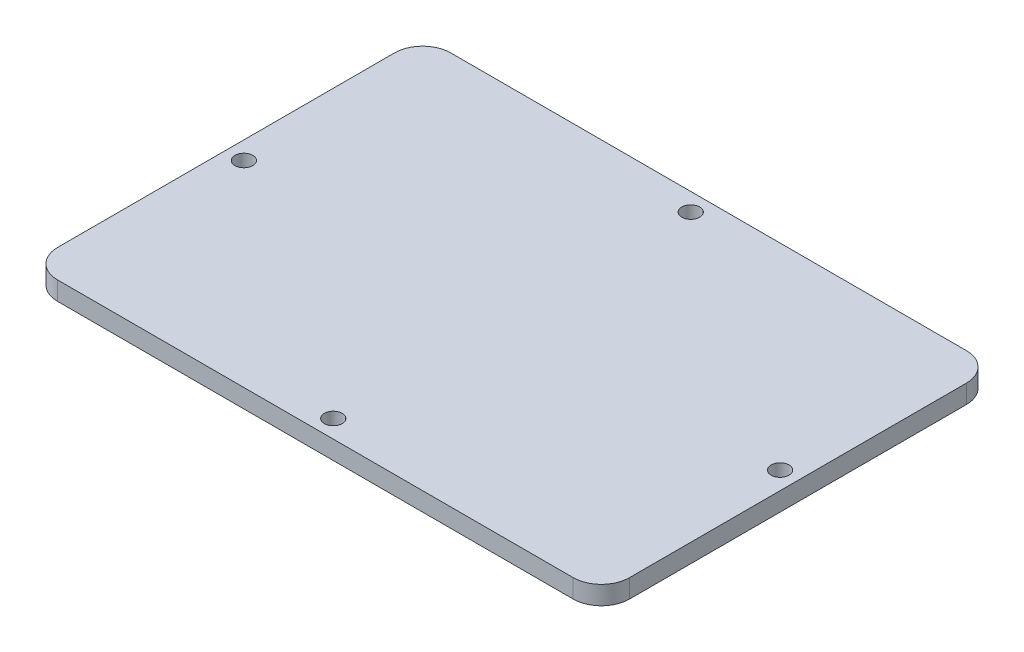
ISO-10303-21;
HEADER;
FILE_DESCRIPTION(('STEP AP214'),'2;1');
FILE_NAME('part.step','',(''),(''),'','','');
FILE_SCHEMA(('AUTOMOTIVE_DESIGN { 1 0 10303 214 1 1 1 1 }'));
ENDSEC;
DATA;
#1=APPLICATION_CONTEXT('core data for automotive mechanical design processes');
#2=APPLICATION_PROTOCOL_DEFINITION('international standard','automotive_design',2000,#1);
#3=PRODUCT_CONTEXT('',#1,'mechanical');
#4=PRODUCT('Part','Part','',(#3));
#5=PRODUCT_RELATED_PRODUCT_CATEGORY('part','',(#4));
#6=PRODUCT_DEFINITION_FORMATION('','',#4);
#7=PRODUCT_DEFINITION_CONTEXT('part definition',#1,'design');
#8=PRODUCT_DEFINITION('design','',#6,#7);
#9=PRODUCT_DEFINITION_SHAPE('','',#8);
#10=(LENGTH_UNIT() NAMED_UNIT(*) SI_UNIT(.MILLI.,.METRE.));
#11=(NAMED_UNIT(*) PLANE_ANGLE_UNIT() SI_UNIT($,.RADIAN.));
#12=(NAMED_UNIT(*) SI_UNIT($,.STERADIAN.) SOLID_ANGLE_UNIT());
#13=UNCERTAINTY_MEASURE_WITH_UNIT(LENGTH_MEASURE(1.E-05),#10,'distance_accuracy_value','');
#14=(GEOMETRIC_REPRESENTATION_CONTEXT(3) GLOBAL_UNCERTAINTY_ASSIGNED_CONTEXT((#13)) GLOBAL_UNIT_ASSIGNED_CONTEXT((#10,
#11,#12)) REPRESENTATION_CONTEXT('',''));
#15=CARTESIAN_POINT('',(0.,0.,0.));
#16=DIRECTION('',(0.,0.,1.));
#17=DIRECTION('',(1.,0.,0.));
#18=AXIS2_PLACEMENT_3D('',#15,#16,#17);
#19=CARTESIAN_POINT('',(50.8,3.302,34.925));
#20=DIRECTION('',(-1.,0.,0.));
#21=DIRECTION('',(0.,0.,1.));
#22=AXIS2_PLACEMENT_3D('',#19,#20,#21);
#23=PLANE('',#22);
#24=DIRECTION('',(0.,0.,-1.));
#25=VECTOR('',#24,1.);
#26=CARTESIAN_POINT('',(50.8,0.,34.925));
#27=LINE('',#26,#25);
#28=CARTESIAN_POINT('',(50.8,0.,29.925));
#29=VERTEX_POINT('',#28);
#30=CARTESIAN_POINT('',(50.8,0.,-29.925));
#31=VERTEX_POINT('',#30);
#32=EDGE_CURVE('E128',#29,#31,#27,.T.);
#33=ORIENTED_EDGE('',*,*,#32,.T.);
#34=DIRECTION('',(0.,-1.,0.));
#35=VECTOR('',#34,1.);
#36=CARTESIAN_POINT('',(50.8,3.302,-29.925));
#37=LINE('',#36,#35);
#38=CARTESIAN_POINT('',(50.8,3.302,-29.925));
#39=VERTEX_POINT('',#38);
#40=EDGE_CURVE('E106',#31,#39,#37,.F.);
#41=ORIENTED_EDGE('',*,*,#40,.T.);
#42=DIRECTION('',(0.,0.,-1.));
#43=VECTOR('',#42,1.);
#44=CARTESIAN_POINT('',(50.8,3.302,34.925));
#45=LINE('',#44,#43);
#46=CARTESIAN_POINT('',(50.8,3.302,29.925));
#47=VERTEX_POINT('',#46);
#48=EDGE_CURVE('E138',#47,#39,#45,.T.);
#49=ORIENTED_EDGE('',*,*,#48,.F.);
#50=DIRECTION('',(0.,-1.,0.));
#51=VECTOR('',#50,1.);
#52=CARTESIAN_POINT('',(50.8,3.302,29.925));
#53=LINE('',#52,#51);
#54=EDGE_CURVE('E111',#47,#29,#53,.T.);
#55=ORIENTED_EDGE('',*,*,#54,.T.);
#56=EDGE_LOOP('',(#33,#41,#49,#55));
#57=FACE_BOUND('',#56,.T.);
#58=ADVANCED_FACE('F35',(#57),#23,.F.);
#59=CARTESIAN_POINT('',(-50.8,3.302,-34.925));
#60=DIRECTION('',(0.,0.,1.));
#61=DIRECTION('',(1.,0.,0.));
#62=AXIS2_PLACEMENT_3D('',#59,#60,#61);
#63=PLANE('',#62);
#64=DIRECTION('',(-1.,0.,0.));
#65=VECTOR('',#64,1.);
#66=CARTESIAN_POINT('',(-50.8,3.302,-34.925));
#67=LINE('',#66,#65);
#68=CARTESIAN_POINT('',(45.8,3.302,-34.925));
#69=VERTEX_POINT('',#68);
#70=CARTESIAN_POINT('',(-45.8,3.302,-34.925));
#71=VERTEX_POINT('',#70);
#72=EDGE_CURVE('E121',#69,#71,#67,.T.);
#73=ORIENTED_EDGE('',*,*,#72,.F.);
#74=DIRECTION('',(0.,-1.,0.));
#75=VECTOR('',#74,1.);
#76=CARTESIAN_POINT('',(45.8,3.302,-34.925));
#77=LINE('',#76,#75);
#78=CARTESIAN_POINT('',(45.8,0.,-34.925));
#79=VERTEX_POINT('',#78);
#80=EDGE_CURVE('E105',#69,#79,#77,.T.);
#81=ORIENTED_EDGE('',*,*,#80,.T.);
#82=DIRECTION('',(-1.,0.,0.));
#83=VECTOR('',#82,1.);
#84=CARTESIAN_POINT('',(-50.8,0.,-34.925));
#85=LINE('',#84,#83);
#86=CARTESIAN_POINT('',(-45.8,0.,-34.925));
#87=VERTEX_POINT('',#86);
#88=EDGE_CURVE('E118',#79,#87,#85,.T.);
#89=ORIENTED_EDGE('',*,*,#88,.T.);
#90=DIRECTION('',(0.,-1.,0.));
#91=VECTOR('',#90,1.);
#92=CARTESIAN_POINT('',(-45.8,3.302,-34.925));
#93=LINE('',#92,#91);
#94=EDGE_CURVE('E123',#87,#71,#93,.F.);
#95=ORIENTED_EDGE('',*,*,#94,.T.);
#96=EDGE_LOOP('',(#73,#81,#89,#95));
#97=FACE_BOUND('',#96,.T.);
#98=ADVANCED_FACE('F117',(#97),#63,.F.);
#99=CARTESIAN_POINT('',(-50.8,3.302,34.925));
#100=DIRECTION('',(1.,0.,0.));
#101=DIRECTION('',(0.,0.,-1.));
#102=AXIS2_PLACEMENT_3D('',#99,#100,#101);
#103=PLANE('',#102);
#104=DIRECTION('',(0.,0.,1.));
#105=VECTOR('',#104,1.);
#106=CARTESIAN_POINT('',(-50.8,0.,34.925));
#107=LINE('',#106,#105);
#108=CARTESIAN_POINT('',(-50.8,0.,-29.925));
#109=VERTEX_POINT('',#108);
#110=CARTESIAN_POINT('',(-50.8,0.,29.925));
#111=VERTEX_POINT('',#110);
#112=EDGE_CURVE('E127',#109,#111,#107,.T.);
#113=ORIENTED_EDGE('',*,*,#112,.T.);
#114=DIRECTION('',(0.,-1.,0.));
#115=VECTOR('',#114,1.);
#116=CARTESIAN_POINT('',(-50.8,3.302,29.925));
#117=LINE('',#116,#115);
#118=CARTESIAN_POINT('',(-50.8,3.302,29.925));
#119=VERTEX_POINT('',#118);
#120=EDGE_CURVE('E11',#111,#119,#117,.F.);
#121=ORIENTED_EDGE('',*,*,#120,.T.);
#122=DIRECTION('',(0.,0.,1.));
#123=VECTOR('',#122,1.);
#124=CARTESIAN_POINT('',(-50.8,3.302,34.925));
#125=LINE('',#124,#123);
#126=CARTESIAN_POINT('',(-50.8,3.302,-29.925));
#127=VERTEX_POINT('',#126);
#128=EDGE_CURVE('E164',#127,#119,#125,.T.);
#129=ORIENTED_EDGE('',*,*,#128,.F.);
#130=DIRECTION('',(0.,-1.,0.));
#131=VECTOR('',#130,1.);
#132=CARTESIAN_POINT('',(-50.8,3.302,-29.925));
#133=LINE('',#132,#131);
#134=EDGE_CURVE('E43',#127,#109,#133,.T.);
#135=ORIENTED_EDGE('',*,*,#134,.T.);
#136=EDGE_LOOP('',(#113,#121,#129,#135));
#137=FACE_BOUND('',#136,.T.);
#138=ADVANCED_FACE('F162',(#137),#103,.F.);
#139=CARTESIAN_POINT('',(-50.8,3.302,34.925));
#140=DIRECTION('',(0.,0.,-1.));
#141=DIRECTION('',(-1.,0.,0.));
#142=AXIS2_PLACEMENT_3D('',#139,#140,#141);
#143=PLANE('',#142);
#144=DIRECTION('',(1.,0.,0.));
#145=VECTOR('',#144,1.);
#146=CARTESIAN_POINT('',(-50.8,0.,34.925));
#147=LINE('',#146,#145);
#148=CARTESIAN_POINT('',(-45.8,0.,34.925));
#149=VERTEX_POINT('',#148);
#150=CARTESIAN_POINT('',(45.8,0.,34.925));
#151=VERTEX_POINT('',#150);
#152=EDGE_CURVE('E131',#149,#151,#147,.T.);
#153=ORIENTED_EDGE('',*,*,#152,.T.);
#154=DIRECTION('',(0.,-1.,0.));
#155=VECTOR('',#154,1.);
#156=CARTESIAN_POINT('',(45.8,3.302,34.925));
#157=LINE('',#156,#155);
#158=CARTESIAN_POINT('',(45.8,3.302,34.925));
#159=VERTEX_POINT('',#158);
#160=EDGE_CURVE('E50',#151,#159,#157,.F.);
#161=ORIENTED_EDGE('',*,*,#160,.T.);
#162=DIRECTION('',(1.,0.,0.));
#163=VECTOR('',#162,1.);
#164=CARTESIAN_POINT('',(-50.8,3.302,34.925));
#165=LINE('',#164,#163);
#166=CARTESIAN_POINT('',(-45.8,3.302,34.925));
#167=VERTEX_POINT('',#166);
#168=EDGE_CURVE('E139',#167,#159,#165,.T.);
#169=ORIENTED_EDGE('',*,*,#168,.F.);
#170=DIRECTION('',(0.,-1.,0.));
#171=VECTOR('',#170,1.);
#172=CARTESIAN_POINT('',(-45.8,3.302,34.925));
#173=LINE('',#172,#171);
#174=EDGE_CURVE('E155',#167,#149,#173,.T.);
#175=ORIENTED_EDGE('',*,*,#174,.T.);
#176=EDGE_LOOP('',(#153,#161,#169,#175));
#177=FACE_BOUND('',#176,.T.);
#178=ADVANCED_FACE('F171',(#177),#143,.F.);
#179=CARTESIAN_POINT('',(0.,3.302,0.));
#180=DIRECTION('',(0.,-1.,0.));
#181=DIRECTION('',(0.,0.,-1.));
#182=AXIS2_PLACEMENT_3D('',#179,#180,#181);
#183=PLANE('',#182);
#184=CARTESIAN_POINT('',(0.,3.302,-31.75));
#185=DIRECTION('',(0.,-1.,0.));
#186=DIRECTION('',(0.,0.,-1.));
#187=AXIS2_PLACEMENT_3D('',#184,#185,#186);
#188=CIRCLE('',#187,1.5875);
#189=CARTESIAN_POINT('',(0.,3.302,-33.3375));
#190=VERTEX_POINT('',#189);
#191=EDGE_CURVE('E133',#190,#190,#188,.T.);
#192=ORIENTED_EDGE('',*,*,#191,.T.);
#193=EDGE_LOOP('',(#192));
#194=FACE_BOUND('',#193,.T.);
#195=CARTESIAN_POINT('',(47.625,3.302,0.));
#196=DIRECTION('',(0.,-1.,0.));
#197=DIRECTION('',(0.,0.,-1.));
#198=AXIS2_PLACEMENT_3D('',#195,#196,#197);
#199=CIRCLE('',#198,1.5875);
#200=CARTESIAN_POINT('',(47.625,3.302,-1.58749999999999));
#201=VERTEX_POINT('',#200);
#202=EDGE_CURVE('E193',#201,#201,#199,.T.);
#203=ORIENTED_EDGE('',*,*,#202,.T.);
#204=EDGE_LOOP('',(#203));
#205=FACE_BOUND('',#204,.T.);
#206=CARTESIAN_POINT('',(0.,3.302,31.75));
#207=DIRECTION('',(0.,-1.,0.));
#208=DIRECTION('',(0.,0.,-1.));
#209=AXIS2_PLACEMENT_3D('',#206,#207,#208);
#210=CIRCLE('',#209,1.5875);
#211=CARTESIAN_POINT('',(0.,3.302,30.1625));
#212=VERTEX_POINT('',#211);
#213=EDGE_CURVE('E187',#212,#212,#210,.T.);
#214=ORIENTED_EDGE('',*,*,#213,.T.);
#215=EDGE_LOOP('',(#214));
#216=FACE_BOUND('',#215,.T.);
#217=CARTESIAN_POINT('',(-47.625,3.302,0.));
#218=DIRECTION('',(0.,-1.,0.));
#219=DIRECTION('',(0.,0.,-1.));
#220=AXIS2_PLACEMENT_3D('',#217,#218,#219);
#221=CIRCLE('',#220,1.5875);
#222=CARTESIAN_POINT('',(-47.625,3.302,-1.58750000000001));
#223=VERTEX_POINT('',#222);
#224=EDGE_CURVE('E181',#223,#223,#221,.T.);
#225=ORIENTED_EDGE('',*,*,#224,.T.);
#226=EDGE_LOOP('',(#225));
#227=FACE_BOUND('',#226,.T.);
#228=ORIENTED_EDGE('',*,*,#48,.T.);
#229=CARTESIAN_POINT('',(45.8,3.302,-29.925));
#230=DIRECTION('',(0.,-1.,0.));
#231=DIRECTION('',(0.,0.,-1.));
#232=AXIS2_PLACEMENT_3D('',#229,#230,#231);
#233=CIRCLE('',#232,5.);
#234=EDGE_CURVE('E153',#39,#69,#233,.F.);
#235=ORIENTED_EDGE('',*,*,#234,.T.);
#236=ORIENTED_EDGE('',*,*,#72,.T.);
#237=CARTESIAN_POINT('',(-45.8,3.302,-29.925));
#238=DIRECTION('',(0.,-1.,0.));
#239=DIRECTION('',(0.,0.,-1.));
#240=AXIS2_PLACEMENT_3D('',#237,#238,#239);
#241=CIRCLE('',#240,5.);
#242=EDGE_CURVE('E148',#71,#127,#241,.F.);
#243=ORIENTED_EDGE('',*,*,#242,.T.);
#244=ORIENTED_EDGE('',*,*,#128,.T.);
#245=CARTESIAN_POINT('',(-45.8,3.302,29.925));
#246=DIRECTION('',(0.,-1.,0.));
#247=DIRECTION('',(0.,0.,-1.));
#248=AXIS2_PLACEMENT_3D('',#245,#246,#247);
#249=CIRCLE('',#248,5.);
#250=EDGE_CURVE('E57',#119,#167,#249,.F.);
#251=ORIENTED_EDGE('',*,*,#250,.T.);
#252=ORIENTED_EDGE('',*,*,#168,.T.);
#253=CARTESIAN_POINT('',(45.8,3.302,29.925));
#254=DIRECTION('',(0.,-1.,0.));
#255=DIRECTION('',(0.,0.,-1.));
#256=AXIS2_PLACEMENT_3D('',#253,#254,#255);
#257=CIRCLE('',#256,5.);
#258=EDGE_CURVE('E151',#159,#47,#257,.F.);
#259=ORIENTED_EDGE('',*,*,#258,.T.);
#260=EDGE_LOOP('',(#228,#235,#236,#243,#244,#251,#252,#259));
#261=FACE_BOUND('',#260,.T.);
#262=ADVANCED_FACE('F202',(#194,#205,#216,#227,#261),#183,.F.);
#263=CARTESIAN_POINT('',(0.,0.,0.));
#264=DIRECTION('',(0.,-1.,0.));
#265=DIRECTION('',(0.,0.,-1.));
#266=AXIS2_PLACEMENT_3D('',#263,#264,#265);
#267=PLANE('',#266);
#268=CARTESIAN_POINT('',(0.,0.,-31.75));
#269=DIRECTION('',(0.,-1.,0.));
#270=DIRECTION('',(0.,0.,-1.));
#271=AXIS2_PLACEMENT_3D('',#268,#269,#270);
#272=CIRCLE('',#271,1.5875);
#273=CARTESIAN_POINT('',(0.,0.,-33.3375));
#274=VERTEX_POINT('',#273);
#275=EDGE_CURVE('E196',#274,#274,#272,.T.);
#276=ORIENTED_EDGE('',*,*,#275,.F.);
#277=EDGE_LOOP('',(#276));
#278=FACE_BOUND('',#277,.T.);
#279=CARTESIAN_POINT('',(47.625,0.,0.));
#280=DIRECTION('',(0.,-1.,0.));
#281=DIRECTION('',(0.,0.,-1.));
#282=AXIS2_PLACEMENT_3D('',#279,#280,#281);
#283=CIRCLE('',#282,1.5875);
#284=CARTESIAN_POINT('',(47.625,0.,-1.58749999999999));
#285=VERTEX_POINT('',#284);
#286=EDGE_CURVE('E190',#285,#285,#283,.T.);
#287=ORIENTED_EDGE('',*,*,#286,.F.);
#288=EDGE_LOOP('',(#287));
#289=FACE_BOUND('',#288,.T.);
#290=CARTESIAN_POINT('',(0.,0.,31.75));
#291=DIRECTION('',(0.,-1.,0.));
#292=DIRECTION('',(0.,0.,-1.));
#293=AXIS2_PLACEMENT_3D('',#290,#291,#292);
#294=CIRCLE('',#293,1.5875);
#295=CARTESIAN_POINT('',(0.,0.,30.1625));
#296=VERTEX_POINT('',#295);
#297=EDGE_CURVE('E184',#296,#296,#294,.T.);
#298=ORIENTED_EDGE('',*,*,#297,.F.);
#299=EDGE_LOOP('',(#298));
#300=FACE_BOUND('',#299,.T.);
#301=CARTESIAN_POINT('',(-47.625,0.,0.));
#302=DIRECTION('',(0.,-1.,0.));
#303=DIRECTION('',(0.,0.,-1.));
#304=AXIS2_PLACEMENT_3D('',#301,#302,#303);
#305=CIRCLE('',#304,1.5875);
#306=CARTESIAN_POINT('',(-47.625,0.,-1.58750000000001));
#307=VERTEX_POINT('',#306);
#308=EDGE_CURVE('E178',#307,#307,#305,.T.);
#309=ORIENTED_EDGE('',*,*,#308,.F.);
#310=EDGE_LOOP('',(#309));
#311=FACE_BOUND('',#310,.T.);
#312=ORIENTED_EDGE('',*,*,#88,.F.);
#313=CARTESIAN_POINT('',(45.8,0.,-29.925));
#314=DIRECTION('',(0.,-1.,0.));
#315=DIRECTION('',(0.,0.,-1.));
#316=AXIS2_PLACEMENT_3D('',#313,#314,#315);
#317=CIRCLE('',#316,5.);
#318=EDGE_CURVE('E101',#79,#31,#317,.T.);
#319=ORIENTED_EDGE('',*,*,#318,.T.);
#320=ORIENTED_EDGE('',*,*,#32,.F.);
#321=CARTESIAN_POINT('',(45.8,0.,29.925));
#322=DIRECTION('',(0.,-1.,0.));
#323=DIRECTION('',(0.,0.,-1.));
#324=AXIS2_PLACEMENT_3D('',#321,#322,#323);
#325=CIRCLE('',#324,5.);
#326=EDGE_CURVE('E112',#29,#151,#325,.T.);
#327=ORIENTED_EDGE('',*,*,#326,.T.);
#328=ORIENTED_EDGE('',*,*,#152,.F.);
#329=CARTESIAN_POINT('',(-45.8,0.,29.925));
#330=DIRECTION('',(0.,-1.,0.));
#331=DIRECTION('',(0.,0.,-1.));
#332=AXIS2_PLACEMENT_3D('',#329,#330,#331);
#333=CIRCLE('',#332,5.);
#334=EDGE_CURVE('E142',#149,#111,#333,.T.);
#335=ORIENTED_EDGE('',*,*,#334,.T.);
#336=ORIENTED_EDGE('',*,*,#112,.F.);
#337=CARTESIAN_POINT('',(-45.8,0.,-29.925));
#338=DIRECTION('',(0.,-1.,0.));
#339=DIRECTION('',(0.,0.,-1.));
#340=AXIS2_PLACEMENT_3D('',#337,#338,#339);
#341=CIRCLE('',#340,5.);
#342=EDGE_CURVE('E122',#109,#87,#341,.T.);
#343=ORIENTED_EDGE('',*,*,#342,.T.);
#344=EDGE_LOOP('',(#312,#319,#320,#327,#328,#335,#336,#343));
#345=FACE_BOUND('',#344,.T.);
#346=ADVANCED_FACE('F125',(#278,#289,#300,#311,#345),#267,.T.);
#347=CARTESIAN_POINT('',(-47.625,3.302,0.));
#348=DIRECTION('',(0.,-1.,0.));
#349=DIRECTION('',(0.,0.,-1.));
#350=AXIS2_PLACEMENT_3D('',#347,#348,#349);
#351=CYLINDRICAL_SURFACE('',#350,1.5875);
#352=ORIENTED_EDGE('',*,*,#224,.F.);
#353=EDGE_LOOP('',(#352));
#354=FACE_BOUND('',#353,.T.);
#355=ORIENTED_EDGE('',*,*,#308,.T.);
#356=EDGE_LOOP('',(#355));
#357=FACE_BOUND('',#356,.T.);
#358=ADVANCED_FACE('F214',(#354,#357),#351,.F.);
#359=CARTESIAN_POINT('',(0.,3.302,31.75));
#360=DIRECTION('',(0.,-1.,0.));
#361=DIRECTION('',(0.,0.,-1.));
#362=AXIS2_PLACEMENT_3D('',#359,#360,#361);
#363=CYLINDRICAL_SURFACE('',#362,1.5875);
#364=ORIENTED_EDGE('',*,*,#213,.F.);
#365=EDGE_LOOP('',(#364));
#366=FACE_BOUND('',#365,.T.);
#367=ORIENTED_EDGE('',*,*,#297,.T.);
#368=EDGE_LOOP('',(#367));
#369=FACE_BOUND('',#368,.T.);
#370=ADVANCED_FACE('F223',(#366,#369),#363,.F.);
#371=CARTESIAN_POINT('',(47.625,3.302,0.));
#372=DIRECTION('',(0.,-1.,0.));
#373=DIRECTION('',(0.,0.,-1.));
#374=AXIS2_PLACEMENT_3D('',#371,#372,#373);
#375=CYLINDRICAL_SURFACE('',#374,1.5875);
#376=ORIENTED_EDGE('',*,*,#202,.F.);
#377=EDGE_LOOP('',(#376));
#378=FACE_BOUND('',#377,.T.);
#379=ORIENTED_EDGE('',*,*,#286,.T.);
#380=EDGE_LOOP('',(#379));
#381=FACE_BOUND('',#380,.T.);
#382=ADVANCED_FACE('F208',(#378,#381),#375,.F.);
#383=CARTESIAN_POINT('',(0.,3.302,-31.75));
#384=DIRECTION('',(0.,-1.,0.));
#385=DIRECTION('',(0.,0.,-1.));
#386=AXIS2_PLACEMENT_3D('',#383,#384,#385);
#387=CYLINDRICAL_SURFACE('',#386,1.5875);
#388=ORIENTED_EDGE('',*,*,#191,.F.);
#389=EDGE_LOOP('',(#388));
#390=FACE_BOUND('',#389,.T.);
#391=ORIENTED_EDGE('',*,*,#275,.T.);
#392=EDGE_LOOP('',(#391));
#393=FACE_BOUND('',#392,.T.);
#394=ADVANCED_FACE('F205',(#390,#393),#387,.F.);
#395=CARTESIAN_POINT('',(45.8,3.302,-29.925));
#396=DIRECTION('',(0.,-1.,0.));
#397=DIRECTION('',(0.,0.,-1.));
#398=AXIS2_PLACEMENT_3D('',#395,#396,#397);
#399=CYLINDRICAL_SURFACE('',#398,5.);
#400=ORIENTED_EDGE('',*,*,#234,.F.);
#401=ORIENTED_EDGE('',*,*,#40,.F.);
#402=ORIENTED_EDGE('',*,*,#318,.F.);
#403=ORIENTED_EDGE('',*,*,#80,.F.);
#404=EDGE_LOOP('',(#400,#401,#402,#403));
#405=FACE_BOUND('',#404,.T.);
#406=ADVANCED_FACE('F104',(#405),#399,.T.);
#407=CARTESIAN_POINT('',(45.8,3.302,29.925));
#408=DIRECTION('',(0.,-1.,0.));
#409=DIRECTION('',(0.,0.,-1.));
#410=AXIS2_PLACEMENT_3D('',#407,#408,#409);
#411=CYLINDRICAL_SURFACE('',#410,5.);
#412=ORIENTED_EDGE('',*,*,#258,.F.);
#413=ORIENTED_EDGE('',*,*,#160,.F.);
#414=ORIENTED_EDGE('',*,*,#326,.F.);
#415=ORIENTED_EDGE('',*,*,#54,.F.);
#416=EDGE_LOOP('',(#412,#413,#414,#415));
#417=FACE_BOUND('',#416,.T.);
#418=ADVANCED_FACE('F244',(#417),#411,.T.);
#419=CARTESIAN_POINT('',(-45.8,3.302,29.925));
#420=DIRECTION('',(0.,-1.,0.));
#421=DIRECTION('',(0.,0.,-1.));
#422=AXIS2_PLACEMENT_3D('',#419,#420,#421);
#423=CYLINDRICAL_SURFACE('',#422,5.);
#424=ORIENTED_EDGE('',*,*,#250,.F.);
#425=ORIENTED_EDGE('',*,*,#120,.F.);
#426=ORIENTED_EDGE('',*,*,#334,.F.);
#427=ORIENTED_EDGE('',*,*,#174,.F.);
#428=EDGE_LOOP('',(#424,#425,#426,#427));
#429=FACE_BOUND('',#428,.T.);
#430=ADVANCED_FACE('F170',(#429),#423,.T.);
#431=CARTESIAN_POINT('',(-45.8,3.302,-29.925));
#432=DIRECTION('',(0.,-1.,0.));
#433=DIRECTION('',(0.,0.,-1.));
#434=AXIS2_PLACEMENT_3D('',#431,#432,#433);
#435=CYLINDRICAL_SURFACE('',#434,5.);
#436=ORIENTED_EDGE('',*,*,#242,.F.);
#437=ORIENTED_EDGE('',*,*,#94,.F.);
#438=ORIENTED_EDGE('',*,*,#342,.F.);
#439=ORIENTED_EDGE('',*,*,#134,.F.);
#440=EDGE_LOOP('',(#436,#437,#438,#439));
#441=FACE_BOUND('',#440,.T.);
#442=ADVANCED_FACE('F37',(#441),#435,.T.);
#443=CLOSED_SHELL('',(#58,#98,#138,#178,#262,#346,#358,#370,#382,#394,#406,#418,#430,#442));
#444=MANIFOLD_SOLID_BREP('B2',#443);
#445=ADVANCED_BREP_SHAPE_REPRESENTATION('',(#18,#444),#14);
#446=SHAPE_DEFINITION_REPRESENTATION(#9,#445);
ENDSEC;
END-ISO-10303-21;
